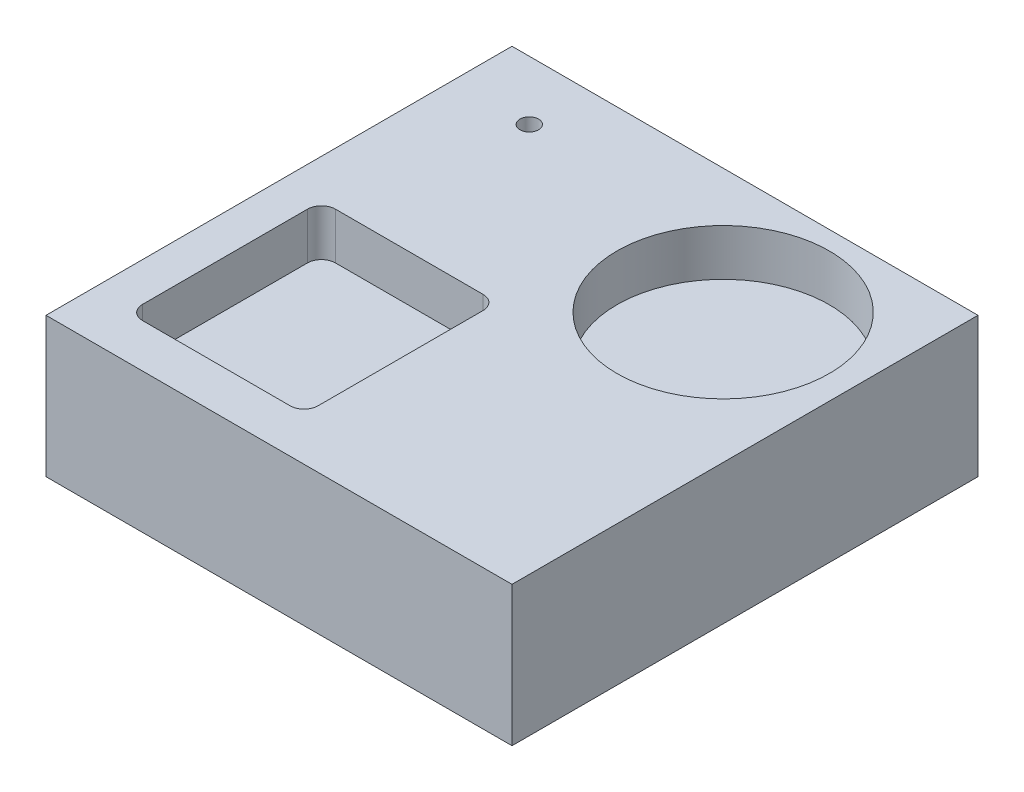
ISO-10303-21;
HEADER;
FILE_DESCRIPTION(('STEP AP214'),'2;1');
FILE_NAME('part.step','',(''),(''),'','','');
FILE_SCHEMA(('AUTOMOTIVE_DESIGN { 1 0 10303 214 1 1 1 1 }'));
ENDSEC;
DATA;
#1=APPLICATION_CONTEXT('core data for automotive mechanical design processes');
#2=APPLICATION_PROTOCOL_DEFINITION('international standard','automotive_design',2000,#1);
#3=PRODUCT_CONTEXT('',#1,'mechanical');
#4=PRODUCT('Part','Part','',(#3));
#5=PRODUCT_RELATED_PRODUCT_CATEGORY('part','',(#4));
#6=PRODUCT_DEFINITION_FORMATION('','',#4);
#7=PRODUCT_DEFINITION_CONTEXT('part definition',#1,'design');
#8=PRODUCT_DEFINITION('design','',#6,#7);
#9=PRODUCT_DEFINITION_SHAPE('','',#8);
#10=(LENGTH_UNIT() NAMED_UNIT(*) SI_UNIT(.MILLI.,.METRE.));
#11=(NAMED_UNIT(*) PLANE_ANGLE_UNIT() SI_UNIT($,.RADIAN.));
#12=(NAMED_UNIT(*) SI_UNIT($,.STERADIAN.) SOLID_ANGLE_UNIT());
#13=UNCERTAINTY_MEASURE_WITH_UNIT(LENGTH_MEASURE(1.E-05),#10,'distance_accuracy_value','');
#14=(GEOMETRIC_REPRESENTATION_CONTEXT(3) GLOBAL_UNCERTAINTY_ASSIGNED_CONTEXT((#13)) GLOBAL_UNIT_ASSIGNED_CONTEXT((#10,
#11,#12)) REPRESENTATION_CONTEXT('',''));
#15=CARTESIAN_POINT('',(0.,0.,0.));
#16=DIRECTION('',(0.,0.,1.));
#17=DIRECTION('',(1.,0.,0.));
#18=AXIS2_PLACEMENT_3D('',#15,#16,#17);
#19=CARTESIAN_POINT('',(0.,30.,0.));
#20=DIRECTION('',(1.,0.,0.));
#21=DIRECTION('',(0.,0.,-1.));
#22=AXIS2_PLACEMENT_3D('',#19,#20,#21);
#23=PLANE('',#22);
#24=DIRECTION('',(0.,0.,1.));
#25=VECTOR('',#24,1.);
#26=CARTESIAN_POINT('',(0.,0.,0.));
#27=LINE('',#26,#25);
#28=CARTESIAN_POINT('',(0.,0.,-100.));
#29=VERTEX_POINT('',#28);
#30=CARTESIAN_POINT('',(0.,0.,0.));
#31=VERTEX_POINT('',#30);
#32=EDGE_CURVE('E163',#29,#31,#27,.T.);
#33=ORIENTED_EDGE('',*,*,#32,.T.);
#34=DIRECTION('',(0.,-1.,0.));
#35=VECTOR('',#34,1.);
#36=CARTESIAN_POINT('',(0.,30.,0.));
#37=LINE('',#36,#35);
#38=CARTESIAN_POINT('',(0.,30.,0.));
#39=VERTEX_POINT('',#38);
#40=EDGE_CURVE('E142',#39,#31,#37,.T.);
#41=ORIENTED_EDGE('',*,*,#40,.F.);
#42=DIRECTION('',(0.,0.,1.));
#43=VECTOR('',#42,1.);
#44=CARTESIAN_POINT('',(0.,30.,0.));
#45=LINE('',#44,#43);
#46=CARTESIAN_POINT('',(0.,30.,-100.));
#47=VERTEX_POINT('',#46);
#48=EDGE_CURVE('E150',#47,#39,#45,.T.);
#49=ORIENTED_EDGE('',*,*,#48,.F.);
#50=DIRECTION('',(0.,-1.,0.));
#51=VECTOR('',#50,1.);
#52=CARTESIAN_POINT('',(0.,30.,-100.));
#53=LINE('',#52,#51);
#54=EDGE_CURVE('E330',#47,#29,#53,.T.);
#55=ORIENTED_EDGE('',*,*,#54,.T.);
#56=EDGE_LOOP('',(#33,#41,#49,#55));
#57=FACE_BOUND('',#56,.T.);
#58=ADVANCED_FACE('F48',(#57),#23,.F.);
#59=CARTESIAN_POINT('',(0.,30.,0.));
#60=DIRECTION('',(0.,0.,-1.));
#61=DIRECTION('',(-1.,0.,0.));
#62=AXIS2_PLACEMENT_3D('',#59,#60,#61);
#63=PLANE('',#62);
#64=DIRECTION('',(1.,0.,0.));
#65=VECTOR('',#64,1.);
#66=CARTESIAN_POINT('',(0.,0.,0.));
#67=LINE('',#66,#65);
#68=CARTESIAN_POINT('',(100.,0.,0.));
#69=VERTEX_POINT('',#68);
#70=EDGE_CURVE('E333',#31,#69,#67,.T.);
#71=ORIENTED_EDGE('',*,*,#70,.T.);
#72=DIRECTION('',(0.,-1.,0.));
#73=VECTOR('',#72,1.);
#74=CARTESIAN_POINT('',(100.,30.,0.));
#75=LINE('',#74,#73);
#76=CARTESIAN_POINT('',(100.,30.,0.));
#77=VERTEX_POINT('',#76);
#78=EDGE_CURVE('E145',#77,#69,#75,.T.);
#79=ORIENTED_EDGE('',*,*,#78,.F.);
#80=DIRECTION('',(1.,0.,0.));
#81=VECTOR('',#80,1.);
#82=CARTESIAN_POINT('',(0.,30.,0.));
#83=LINE('',#82,#81);
#84=EDGE_CURVE('E138',#39,#77,#83,.T.);
#85=ORIENTED_EDGE('',*,*,#84,.F.);
#86=ORIENTED_EDGE('',*,*,#40,.T.);
#87=EDGE_LOOP('',(#71,#79,#85,#86));
#88=FACE_BOUND('',#87,.T.);
#89=ADVANCED_FACE('F140',(#88),#63,.F.);
#90=CARTESIAN_POINT('',(100.,30.,0.));
#91=DIRECTION('',(-1.,0.,0.));
#92=DIRECTION('',(0.,0.,1.));
#93=AXIS2_PLACEMENT_3D('',#90,#91,#92);
#94=PLANE('',#93);
#95=DIRECTION('',(0.,0.,-1.));
#96=VECTOR('',#95,1.);
#97=CARTESIAN_POINT('',(100.,0.,0.));
#98=LINE('',#97,#96);
#99=CARTESIAN_POINT('',(100.,0.,-100.));
#100=VERTEX_POINT('',#99);
#101=EDGE_CURVE('E336',#69,#100,#98,.T.);
#102=ORIENTED_EDGE('',*,*,#101,.T.);
#103=DIRECTION('',(0.,-1.,0.));
#104=VECTOR('',#103,1.);
#105=CARTESIAN_POINT('',(100.,30.,-100.));
#106=LINE('',#105,#104);
#107=CARTESIAN_POINT('',(100.,30.,-100.));
#108=VERTEX_POINT('',#107);
#109=EDGE_CURVE('E171',#108,#100,#106,.T.);
#110=ORIENTED_EDGE('',*,*,#109,.F.);
#111=DIRECTION('',(0.,0.,-1.));
#112=VECTOR('',#111,1.);
#113=CARTESIAN_POINT('',(100.,30.,0.));
#114=LINE('',#113,#112);
#115=EDGE_CURVE('E149',#77,#108,#114,.T.);
#116=ORIENTED_EDGE('',*,*,#115,.F.);
#117=ORIENTED_EDGE('',*,*,#78,.T.);
#118=EDGE_LOOP('',(#102,#110,#116,#117));
#119=FACE_BOUND('',#118,.T.);
#120=ADVANCED_FACE('F373',(#119),#94,.F.);
#121=CARTESIAN_POINT('',(0.,30.,-100.));
#122=DIRECTION('',(0.,0.,1.));
#123=DIRECTION('',(1.,0.,0.));
#124=AXIS2_PLACEMENT_3D('',#121,#122,#123);
#125=PLANE('',#124);
#126=DIRECTION('',(-1.,0.,0.));
#127=VECTOR('',#126,1.);
#128=CARTESIAN_POINT('',(0.,0.,-100.));
#129=LINE('',#128,#127);
#130=EDGE_CURVE('E160',#100,#29,#129,.T.);
#131=ORIENTED_EDGE('',*,*,#130,.T.);
#132=ORIENTED_EDGE('',*,*,#54,.F.);
#133=DIRECTION('',(-1.,0.,0.));
#134=VECTOR('',#133,1.);
#135=CARTESIAN_POINT('',(0.,30.,-100.));
#136=LINE('',#135,#134);
#137=EDGE_CURVE('E155',#108,#47,#136,.T.);
#138=ORIENTED_EDGE('',*,*,#137,.F.);
#139=ORIENTED_EDGE('',*,*,#109,.T.);
#140=EDGE_LOOP('',(#131,#132,#138,#139));
#141=FACE_BOUND('',#140,.T.);
#142=ADVANCED_FACE('F368',(#141),#125,.F.);
#143=CARTESIAN_POINT('',(0.,30.,0.));
#144=DIRECTION('',(0.,-1.,0.));
#145=DIRECTION('',(0.,0.,-1.));
#146=AXIS2_PLACEMENT_3D('',#143,#144,#145);
#147=PLANE('',#146);
#148=DIRECTION('',(1.,0.,0.));
#149=VECTOR('',#148,1.);
#150=CARTESIAN_POINT('',(8.32789443786908,30.,-9.37411485810458));
#151=LINE('',#150,#149);
#152=CARTESIAN_POINT('',(11.3278944378691,30.,-9.37411485810458));
#153=VERTEX_POINT('',#152);
#154=CARTESIAN_POINT('',(43.0113838607228,30.,-9.37411485810458));
#155=VERTEX_POINT('',#154);
#156=EDGE_CURVE('E214',#153,#155,#151,.T.);
#157=ORIENTED_EDGE('',*,*,#156,.F.);
#158=CARTESIAN_POINT('',(11.3278944378691,30.,-12.3741148581046));
#159=DIRECTION('',(0.,-1.,0.));
#160=DIRECTION('',(0.,0.,-1.));
#161=AXIS2_PLACEMENT_3D('',#158,#159,#160);
#162=CIRCLE('',#161,3.);
#163=CARTESIAN_POINT('',(8.32789443786908,30.,-12.3741148581046));
#164=VERTEX_POINT('',#163);
#165=EDGE_CURVE('E200',#153,#164,#162,.T.);
#166=ORIENTED_EDGE('',*,*,#165,.T.);
#167=DIRECTION('',(0.,0.,1.));
#168=VECTOR('',#167,1.);
#169=CARTESIAN_POINT('',(8.32789443786908,30.,-50.787427560806));
#170=LINE('',#169,#168);
#171=CARTESIAN_POINT('',(8.32789443786908,30.,-47.787427560806));
#172=VERTEX_POINT('',#171);
#173=EDGE_CURVE('E220',#172,#164,#170,.T.);
#174=ORIENTED_EDGE('',*,*,#173,.F.);
#175=CARTESIAN_POINT('',(11.3278944378691,30.,-47.787427560806));
#176=DIRECTION('',(0.,-1.,0.));
#177=DIRECTION('',(0.,0.,-1.));
#178=AXIS2_PLACEMENT_3D('',#175,#176,#177);
#179=CIRCLE('',#178,3.);
#180=CARTESIAN_POINT('',(11.3278944378691,30.,-50.787427560806));
#181=VERTEX_POINT('',#180);
#182=EDGE_CURVE('E12',#172,#181,#179,.T.);
#183=ORIENTED_EDGE('',*,*,#182,.T.);
#184=DIRECTION('',(-1.,0.,0.));
#185=VECTOR('',#184,1.);
#186=CARTESIAN_POINT('',(8.32789443786908,30.,-50.787427560806));
#187=LINE('',#186,#185);
#188=CARTESIAN_POINT('',(43.0113838607228,30.,-50.787427560806));
#189=VERTEX_POINT('',#188);
#190=EDGE_CURVE('E227',#189,#181,#187,.T.);
#191=ORIENTED_EDGE('',*,*,#190,.F.);
#192=CARTESIAN_POINT('',(43.0113838607228,30.,-47.787427560806));
#193=DIRECTION('',(0.,-1.,0.));
#194=DIRECTION('',(0.,0.,-1.));
#195=AXIS2_PLACEMENT_3D('',#192,#193,#194);
#196=CIRCLE('',#195,3.);
#197=CARTESIAN_POINT('',(46.0113838607228,30.,-47.787427560806));
#198=VERTEX_POINT('',#197);
#199=EDGE_CURVE('E58',#189,#198,#196,.T.);
#200=ORIENTED_EDGE('',*,*,#199,.T.);
#201=DIRECTION('',(0.,0.,-1.));
#202=VECTOR('',#201,1.);
#203=CARTESIAN_POINT('',(46.0113838607228,30.,-50.787427560806));
#204=LINE('',#203,#202);
#205=CARTESIAN_POINT('',(46.0113838607228,30.,-12.3741148581046));
#206=VERTEX_POINT('',#205);
#207=EDGE_CURVE('E219',#206,#198,#204,.T.);
#208=ORIENTED_EDGE('',*,*,#207,.F.);
#209=CARTESIAN_POINT('',(43.0113838607228,30.,-12.3741148581046));
#210=DIRECTION('',(0.,-1.,0.));
#211=DIRECTION('',(0.,0.,-1.));
#212=AXIS2_PLACEMENT_3D('',#209,#210,#211);
#213=CIRCLE('',#212,3.);
#214=EDGE_CURVE('E204',#206,#155,#213,.T.);
#215=ORIENTED_EDGE('',*,*,#214,.T.);
#216=EDGE_LOOP('',(#157,#166,#174,#183,#191,#200,#208,#215));
#217=FACE_BOUND('',#216,.T.);
#218=CARTESIAN_POINT('',(72.0846402277573,30.,-73.2251707576097));
#219=DIRECTION('',(0.,1.,0.));
#220=DIRECTION('',(0.,0.,1.));
#221=AXIS2_PLACEMENT_3D('',#218,#219,#220);
#222=CIRCLE('',#221,22.7899638797003);
#223=CARTESIAN_POINT('',(72.0846402277573,30.,-50.4352068779094));
#224=VERTEX_POINT('',#223);
#225=EDGE_CURVE('E312',#224,#224,#222,.T.);
#226=ORIENTED_EDGE('',*,*,#225,.F.);
#227=EDGE_LOOP('',(#226));
#228=FACE_BOUND('',#227,.T.);
#229=CARTESIAN_POINT('',(16.3843135452169,30.,-87.3231980243077));
#230=DIRECTION('',(0.,1.,0.));
#231=DIRECTION('',(0.,0.,1.));
#232=AXIS2_PLACEMENT_3D('',#229,#230,#231);
#233=CIRCLE('',#232,2.);
#234=CARTESIAN_POINT('',(16.3843135452169,30.,-85.3231980243077));
#235=VERTEX_POINT('',#234);
#236=EDGE_CURVE('E286',#235,#235,#233,.T.);
#237=ORIENTED_EDGE('',*,*,#236,.F.);
#238=EDGE_LOOP('',(#237));
#239=FACE_BOUND('',#238,.T.);
#240=ORIENTED_EDGE('',*,*,#48,.T.);
#241=ORIENTED_EDGE('',*,*,#84,.T.);
#242=ORIENTED_EDGE('',*,*,#115,.T.);
#243=ORIENTED_EDGE('',*,*,#137,.T.);
#244=EDGE_LOOP('',(#240,#241,#242,#243));
#245=FACE_BOUND('',#244,.T.);
#246=ADVANCED_FACE('F153',(#217,#228,#239,#245),#147,.F.);
#247=CARTESIAN_POINT('',(0.,0.,0.));
#248=DIRECTION('',(0.,-1.,0.));
#249=DIRECTION('',(0.,0.,-1.));
#250=AXIS2_PLACEMENT_3D('',#247,#248,#249);
#251=PLANE('',#250);
#252=CARTESIAN_POINT('',(16.3843135452169,0.,-87.3231980243077));
#253=DIRECTION('',(0.,1.,0.));
#254=DIRECTION('',(0.,0.,1.));
#255=AXIS2_PLACEMENT_3D('',#252,#253,#254);
#256=CIRCLE('',#255,2.);
#257=CARTESIAN_POINT('',(16.3843135452169,0.,-85.3231980243077));
#258=VERTEX_POINT('',#257);
#259=EDGE_CURVE('E320',#258,#258,#256,.T.);
#260=ORIENTED_EDGE('',*,*,#259,.T.);
#261=EDGE_LOOP('',(#260));
#262=FACE_BOUND('',#261,.T.);
#263=ORIENTED_EDGE('',*,*,#32,.F.);
#264=ORIENTED_EDGE('',*,*,#130,.F.);
#265=ORIENTED_EDGE('',*,*,#101,.F.);
#266=ORIENTED_EDGE('',*,*,#70,.F.);
#267=EDGE_LOOP('',(#263,#264,#265,#266));
#268=FACE_BOUND('',#267,.T.);
#269=ADVANCED_FACE('F372',(#262,#268),#251,.T.);
#270=CARTESIAN_POINT('',(16.3843135452169,0.,-87.3231980243077));
#271=DIRECTION('',(0.,1.,0.));
#272=DIRECTION('',(0.,0.,1.));
#273=AXIS2_PLACEMENT_3D('',#270,#271,#272);
#274=CYLINDRICAL_SURFACE('',#273,2.);
#275=ORIENTED_EDGE('',*,*,#259,.F.);
#276=EDGE_LOOP('',(#275));
#277=FACE_BOUND('',#276,.T.);
#278=ORIENTED_EDGE('',*,*,#236,.T.);
#279=EDGE_LOOP('',(#278));
#280=FACE_BOUND('',#279,.T.);
#281=ADVANCED_FACE('F428',(#277,#280),#274,.F.);
#282=CARTESIAN_POINT('',(72.0846402277573,20.,-73.2251707576097));
#283=DIRECTION('',(0.,1.,0.));
#284=DIRECTION('',(0.,0.,1.));
#285=AXIS2_PLACEMENT_3D('',#282,#283,#284);
#286=CYLINDRICAL_SURFACE('',#285,22.7899638797003);
#287=CARTESIAN_POINT('',(72.0846402277573,20.,-73.2251707576097));
#288=DIRECTION('',(0.,1.,0.));
#289=DIRECTION('',(0.,0.,1.));
#290=AXIS2_PLACEMENT_3D('',#287,#288,#289);
#291=CIRCLE('',#290,22.7899638797003);
#292=CARTESIAN_POINT('',(72.0846402277573,20.,-50.4352068779094));
#293=VERTEX_POINT('',#292);
#294=EDGE_CURVE('E308',#293,#293,#291,.T.);
#295=ORIENTED_EDGE('',*,*,#294,.F.);
#296=EDGE_LOOP('',(#295));
#297=FACE_BOUND('',#296,.T.);
#298=ORIENTED_EDGE('',*,*,#225,.T.);
#299=EDGE_LOOP('',(#298));
#300=FACE_BOUND('',#299,.T.);
#301=ADVANCED_FACE('F425',(#297,#300),#286,.F.);
#302=CARTESIAN_POINT('',(72.0846402277573,20.,-73.2251707576097));
#303=DIRECTION('',(0.,1.,0.));
#304=DIRECTION('',(0.,0.,1.));
#305=AXIS2_PLACEMENT_3D('',#302,#303,#304);
#306=PLANE('',#305);
#307=ORIENTED_EDGE('',*,*,#294,.T.);
#308=EDGE_LOOP('',(#307));
#309=FACE_BOUND('',#308,.T.);
#310=ADVANCED_FACE('F417',(#309),#306,.T.);
#311=CARTESIAN_POINT('',(8.32789443786908,20.,-50.787427560806));
#312=DIRECTION('',(-1.,0.,0.));
#313=DIRECTION('',(0.,0.,1.));
#314=AXIS2_PLACEMENT_3D('',#311,#312,#313);
#315=PLANE('',#314);
#316=ORIENTED_EDGE('',*,*,#173,.T.);
#317=DIRECTION('',(0.,1.,0.));
#318=VECTOR('',#317,1.);
#319=CARTESIAN_POINT('',(8.32789443786908,20.,-12.3741148581046));
#320=LINE('',#319,#318);
#321=CARTESIAN_POINT('',(8.32789443786908,20.,-12.3741148581046));
#322=VERTEX_POINT('',#321);
#323=EDGE_CURVE('E292',#164,#322,#320,.F.);
#324=ORIENTED_EDGE('',*,*,#323,.T.);
#325=DIRECTION('',(0.,0.,1.));
#326=VECTOR('',#325,1.);
#327=CARTESIAN_POINT('',(8.32789443786908,20.,-50.787427560806));
#328=LINE('',#327,#326);
#329=CARTESIAN_POINT('',(8.32789443786908,20.,-47.787427560806));
#330=VERTEX_POINT('',#329);
#331=EDGE_CURVE('E304',#330,#322,#328,.T.);
#332=ORIENTED_EDGE('',*,*,#331,.F.);
#333=DIRECTION('',(0.,1.,0.));
#334=VECTOR('',#333,1.);
#335=CARTESIAN_POINT('',(8.32789443786908,30.,-47.787427560806));
#336=LINE('',#335,#334);
#337=EDGE_CURVE('E179',#330,#172,#336,.T.);
#338=ORIENTED_EDGE('',*,*,#337,.T.);
#339=EDGE_LOOP('',(#316,#324,#332,#338));
#340=FACE_BOUND('',#339,.T.);
#341=ADVANCED_FACE('F303',(#340),#315,.F.);
#342=CARTESIAN_POINT('',(8.32789443786908,20.,-50.787427560806));
#343=DIRECTION('',(0.,0.,-1.));
#344=DIRECTION('',(-1.,0.,0.));
#345=AXIS2_PLACEMENT_3D('',#342,#343,#344);
#346=PLANE('',#345);
#347=DIRECTION('',(-1.,0.,0.));
#348=VECTOR('',#347,1.);
#349=CARTESIAN_POINT('',(8.32789443786908,20.,-50.787427560806));
#350=LINE('',#349,#348);
#351=CARTESIAN_POINT('',(43.0113838607228,20.,-50.787427560806));
#352=VERTEX_POINT('',#351);
#353=CARTESIAN_POINT('',(11.3278944378691,20.,-50.787427560806));
#354=VERTEX_POINT('',#353);
#355=EDGE_CURVE('E279',#352,#354,#350,.T.);
#356=ORIENTED_EDGE('',*,*,#355,.F.);
#357=DIRECTION('',(0.,1.,0.));
#358=VECTOR('',#357,1.);
#359=CARTESIAN_POINT('',(43.0113838607228,30.,-50.787427560806));
#360=LINE('',#359,#358);
#361=EDGE_CURVE('E196',#352,#189,#360,.T.);
#362=ORIENTED_EDGE('',*,*,#361,.T.);
#363=ORIENTED_EDGE('',*,*,#190,.T.);
#364=DIRECTION('',(0.,1.,0.));
#365=VECTOR('',#364,1.);
#366=CARTESIAN_POINT('',(11.3278944378691,20.,-50.787427560806));
#367=LINE('',#366,#365);
#368=EDGE_CURVE('E192',#181,#354,#367,.F.);
#369=ORIENTED_EDGE('',*,*,#368,.T.);
#370=EDGE_LOOP('',(#356,#362,#363,#369));
#371=FACE_BOUND('',#370,.T.);
#372=ADVANCED_FACE('F402',(#371),#346,.F.);
#373=CARTESIAN_POINT('',(46.0113838607228,20.,-50.787427560806));
#374=DIRECTION('',(1.,0.,0.));
#375=DIRECTION('',(0.,0.,-1.));
#376=AXIS2_PLACEMENT_3D('',#373,#374,#375);
#377=PLANE('',#376);
#378=DIRECTION('',(0.,0.,-1.));
#379=VECTOR('',#378,1.);
#380=CARTESIAN_POINT('',(46.0113838607228,20.,-50.787427560806));
#381=LINE('',#380,#379);
#382=CARTESIAN_POINT('',(46.0113838607228,20.,-12.3741148581046));
#383=VERTEX_POINT('',#382);
#384=CARTESIAN_POINT('',(46.0113838607228,20.,-47.787427560806));
#385=VERTEX_POINT('',#384);
#386=EDGE_CURVE('E277',#383,#385,#381,.T.);
#387=ORIENTED_EDGE('',*,*,#386,.F.);
#388=DIRECTION('',(0.,1.,0.));
#389=VECTOR('',#388,1.);
#390=CARTESIAN_POINT('',(46.0113838607228,30.,-12.3741148581046));
#391=LINE('',#390,#389);
#392=EDGE_CURVE('E186',#383,#206,#391,.T.);
#393=ORIENTED_EDGE('',*,*,#392,.T.);
#394=ORIENTED_EDGE('',*,*,#207,.T.);
#395=DIRECTION('',(0.,1.,0.));
#396=VECTOR('',#395,1.);
#397=CARTESIAN_POINT('',(46.0113838607228,20.,-47.787427560806));
#398=LINE('',#397,#396);
#399=EDGE_CURVE('E193',#198,#385,#398,.F.);
#400=ORIENTED_EDGE('',*,*,#399,.T.);
#401=EDGE_LOOP('',(#387,#393,#394,#400));
#402=FACE_BOUND('',#401,.T.);
#403=ADVANCED_FACE('F409',(#402),#377,.F.);
#404=CARTESIAN_POINT('',(8.32789443786908,20.,-9.37411485810458));
#405=DIRECTION('',(0.,0.,1.));
#406=DIRECTION('',(1.,0.,0.));
#407=AXIS2_PLACEMENT_3D('',#404,#405,#406);
#408=PLANE('',#407);
#409=DIRECTION('',(1.,0.,0.));
#410=VECTOR('',#409,1.);
#411=CARTESIAN_POINT('',(8.32789443786908,20.,-9.37411485810458));
#412=LINE('',#411,#410);
#413=CARTESIAN_POINT('',(11.3278944378691,20.,-9.37411485810458));
#414=VERTEX_POINT('',#413);
#415=CARTESIAN_POINT('',(43.0113838607228,20.,-9.37411485810458));
#416=VERTEX_POINT('',#415);
#417=EDGE_CURVE('E280',#414,#416,#412,.T.);
#418=ORIENTED_EDGE('',*,*,#417,.F.);
#419=DIRECTION('',(0.,1.,0.));
#420=VECTOR('',#419,1.);
#421=CARTESIAN_POINT('',(11.3278944378691,30.,-9.37411485810458));
#422=LINE('',#421,#420);
#423=EDGE_CURVE('E169',#414,#153,#422,.T.);
#424=ORIENTED_EDGE('',*,*,#423,.T.);
#425=ORIENTED_EDGE('',*,*,#156,.T.);
#426=DIRECTION('',(0.,1.,0.));
#427=VECTOR('',#426,1.);
#428=CARTESIAN_POINT('',(43.0113838607228,20.,-9.37411485810458));
#429=LINE('',#428,#427);
#430=EDGE_CURVE('E165',#155,#416,#429,.F.);
#431=ORIENTED_EDGE('',*,*,#430,.T.);
#432=EDGE_LOOP('',(#418,#424,#425,#431));
#433=FACE_BOUND('',#432,.T.);
#434=ADVANCED_FACE('F246',(#433),#408,.F.);
#435=CARTESIAN_POINT('',(0.,20.,0.));
#436=DIRECTION('',(0.,1.,0.));
#437=DIRECTION('',(0.,0.,1.));
#438=AXIS2_PLACEMENT_3D('',#435,#436,#437);
#439=PLANE('',#438);
#440=ORIENTED_EDGE('',*,*,#331,.T.);
#441=CARTESIAN_POINT('',(11.3278944378691,20.,-12.3741148581046));
#442=DIRECTION('',(0.,1.,0.));
#443=DIRECTION('',(0.,0.,1.));
#444=AXIS2_PLACEMENT_3D('',#441,#442,#443);
#445=CIRCLE('',#444,3.);
#446=EDGE_CURVE('E256',#322,#414,#445,.T.);
#447=ORIENTED_EDGE('',*,*,#446,.T.);
#448=ORIENTED_EDGE('',*,*,#417,.T.);
#449=CARTESIAN_POINT('',(43.0113838607228,20.,-12.3741148581046));
#450=DIRECTION('',(0.,1.,0.));
#451=DIRECTION('',(0.,0.,1.));
#452=AXIS2_PLACEMENT_3D('',#449,#450,#451);
#453=CIRCLE('',#452,3.);
#454=EDGE_CURVE('E251',#416,#383,#453,.T.);
#455=ORIENTED_EDGE('',*,*,#454,.T.);
#456=ORIENTED_EDGE('',*,*,#386,.T.);
#457=CARTESIAN_POINT('',(43.0113838607228,20.,-47.787427560806));
#458=DIRECTION('',(0.,1.,0.));
#459=DIRECTION('',(0.,0.,1.));
#460=AXIS2_PLACEMENT_3D('',#457,#458,#459);
#461=CIRCLE('',#460,3.);
#462=EDGE_CURVE('E257',#385,#352,#461,.T.);
#463=ORIENTED_EDGE('',*,*,#462,.T.);
#464=ORIENTED_EDGE('',*,*,#355,.T.);
#465=CARTESIAN_POINT('',(11.3278944378691,20.,-47.787427560806));
#466=DIRECTION('',(0.,1.,0.));
#467=DIRECTION('',(0.,0.,1.));
#468=AXIS2_PLACEMENT_3D('',#465,#466,#467);
#469=CIRCLE('',#468,3.);
#470=EDGE_CURVE('E263',#354,#330,#469,.T.);
#471=ORIENTED_EDGE('',*,*,#470,.T.);
#472=EDGE_LOOP('',(#440,#447,#448,#455,#456,#463,#464,#471));
#473=FACE_BOUND('',#472,.T.);
#474=ADVANCED_FACE('F390',(#473),#439,.T.);
#475=CARTESIAN_POINT('',(11.3278944378691,20.,-12.3741148581046));
#476=DIRECTION('',(0.,-1.,0.));
#477=DIRECTION('',(0.,0.,-1.));
#478=AXIS2_PLACEMENT_3D('',#475,#476,#477);
#479=CYLINDRICAL_SURFACE('',#478,3.);
#480=ORIENTED_EDGE('',*,*,#446,.F.);
#481=ORIENTED_EDGE('',*,*,#323,.F.);
#482=ORIENTED_EDGE('',*,*,#165,.F.);
#483=ORIENTED_EDGE('',*,*,#423,.F.);
#484=EDGE_LOOP('',(#480,#481,#482,#483));
#485=FACE_BOUND('',#484,.T.);
#486=ADVANCED_FACE('F387',(#485),#479,.F.);
#487=CARTESIAN_POINT('',(43.0113838607228,20.,-12.3741148581046));
#488=DIRECTION('',(0.,-1.,0.));
#489=DIRECTION('',(0.,0.,-1.));
#490=AXIS2_PLACEMENT_3D('',#487,#488,#489);
#491=CYLINDRICAL_SURFACE('',#490,3.);
#492=ORIENTED_EDGE('',*,*,#454,.F.);
#493=ORIENTED_EDGE('',*,*,#430,.F.);
#494=ORIENTED_EDGE('',*,*,#214,.F.);
#495=ORIENTED_EDGE('',*,*,#392,.F.);
#496=EDGE_LOOP('',(#492,#493,#494,#495));
#497=FACE_BOUND('',#496,.T.);
#498=ADVANCED_FACE('F250',(#497),#491,.F.);
#499=CARTESIAN_POINT('',(43.0113838607228,20.,-47.787427560806));
#500=DIRECTION('',(0.,-1.,0.));
#501=DIRECTION('',(0.,0.,-1.));
#502=AXIS2_PLACEMENT_3D('',#499,#500,#501);
#503=CYLINDRICAL_SURFACE('',#502,3.);
#504=ORIENTED_EDGE('',*,*,#462,.F.);
#505=ORIENTED_EDGE('',*,*,#399,.F.);
#506=ORIENTED_EDGE('',*,*,#199,.F.);
#507=ORIENTED_EDGE('',*,*,#361,.F.);
#508=EDGE_LOOP('',(#504,#505,#506,#507));
#509=FACE_BOUND('',#508,.T.);
#510=ADVANCED_FACE('F393',(#509),#503,.F.);
#511=CARTESIAN_POINT('',(11.3278944378691,20.,-47.787427560806));
#512=DIRECTION('',(0.,-1.,0.));
#513=DIRECTION('',(0.,0.,-1.));
#514=AXIS2_PLACEMENT_3D('',#511,#512,#513);
#515=CYLINDRICAL_SURFACE('',#514,3.);
#516=ORIENTED_EDGE('',*,*,#470,.F.);
#517=ORIENTED_EDGE('',*,*,#368,.F.);
#518=ORIENTED_EDGE('',*,*,#182,.F.);
#519=ORIENTED_EDGE('',*,*,#337,.F.);
#520=EDGE_LOOP('',(#516,#517,#518,#519));
#521=FACE_BOUND('',#520,.T.);
#522=ADVANCED_FACE('F50',(#521),#515,.F.);
#523=CLOSED_SHELL('',(#58,#89,#120,#142,#246,#269,#281,#301,#310,#341,#372,#403,#434,#474,#486,
#498,#510,#522));
#524=MANIFOLD_SOLID_BREP('B2',#523);
#525=ADVANCED_BREP_SHAPE_REPRESENTATION('',(#18,#524),#14);
#526=SHAPE_DEFINITION_REPRESENTATION(#9,#525);
ENDSEC;
END-ISO-10303-21;
